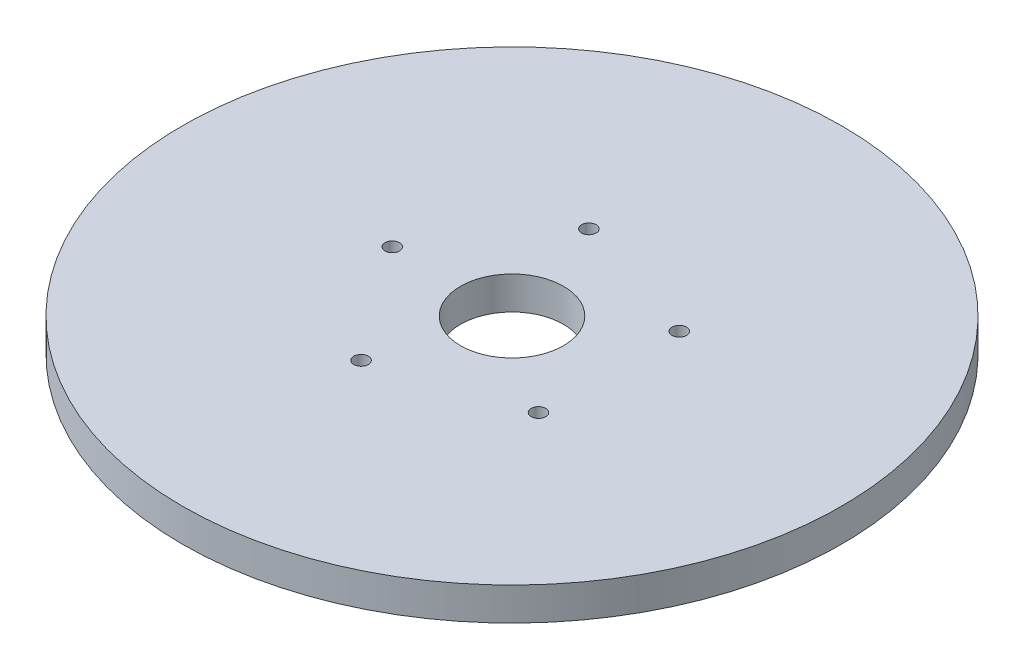
ISO-10303-21;
HEADER;
FILE_DESCRIPTION(('STEP AP214'),'2;1');
FILE_NAME('part.step','',(''),(''),'','','');
FILE_SCHEMA(('AUTOMOTIVE_DESIGN { 1 0 10303 214 1 1 1 1 }'));
ENDSEC;
DATA;
#1=APPLICATION_CONTEXT('core data for automotive mechanical design processes');
#2=APPLICATION_PROTOCOL_DEFINITION('international standard','automotive_design',2000,#1);
#3=PRODUCT_CONTEXT('',#1,'mechanical');
#4=PRODUCT('Part','Part','',(#3));
#5=PRODUCT_RELATED_PRODUCT_CATEGORY('part','',(#4));
#6=PRODUCT_DEFINITION_FORMATION('','',#4);
#7=PRODUCT_DEFINITION_CONTEXT('part definition',#1,'design');
#8=PRODUCT_DEFINITION('design','',#6,#7);
#9=PRODUCT_DEFINITION_SHAPE('','',#8);
#10=(LENGTH_UNIT() NAMED_UNIT(*) SI_UNIT(.MILLI.,.METRE.));
#11=(NAMED_UNIT(*) PLANE_ANGLE_UNIT() SI_UNIT($,.RADIAN.));
#12=(NAMED_UNIT(*) SI_UNIT($,.STERADIAN.) SOLID_ANGLE_UNIT());
#13=UNCERTAINTY_MEASURE_WITH_UNIT(LENGTH_MEASURE(1.E-05),#10,'distance_accuracy_value','');
#14=(GEOMETRIC_REPRESENTATION_CONTEXT(3) GLOBAL_UNCERTAINTY_ASSIGNED_CONTEXT((#13)) GLOBAL_UNIT_ASSIGNED_CONTEXT((#10,
#11,#12)) REPRESENTATION_CONTEXT('',''));
#15=CARTESIAN_POINT('',(0.,0.,0.));
#16=DIRECTION('',(0.,0.,1.));
#17=DIRECTION('',(1.,0.,0.));
#18=AXIS2_PLACEMENT_3D('',#15,#16,#17);
#19=CARTESIAN_POINT('',(0.,8.,0.));
#20=DIRECTION('',(0.,-1.,0.));
#21=DIRECTION('',(0.,0.,-1.));
#22=AXIS2_PLACEMENT_3D('',#19,#20,#21);
#23=CYLINDRICAL_SURFACE('',#22,80.);
#24=CARTESIAN_POINT('',(0.,8.,0.));
#25=DIRECTION('',(0.,1.,0.));
#26=DIRECTION('',(0.,0.,1.));
#27=AXIS2_PLACEMENT_3D('',#24,#25,#26);
#28=CIRCLE('',#27,80.);
#29=CARTESIAN_POINT('',(0.,8.,80.));
#30=VERTEX_POINT('',#29);
#31=EDGE_CURVE('E10',#30,#30,#28,.T.);
#32=ORIENTED_EDGE('',*,*,#31,.F.);
#33=EDGE_LOOP('',(#32));
#34=FACE_BOUND('',#33,.T.);
#35=CARTESIAN_POINT('',(0.,0.,0.));
#36=DIRECTION('',(0.,1.,0.));
#37=DIRECTION('',(0.,0.,1.));
#38=AXIS2_PLACEMENT_3D('',#35,#36,#37);
#39=CIRCLE('',#38,80.);
#40=CARTESIAN_POINT('',(0.,0.,80.));
#41=VERTEX_POINT('',#40);
#42=EDGE_CURVE('E37',#41,#41,#39,.T.);
#43=ORIENTED_EDGE('',*,*,#42,.T.);
#44=EDGE_LOOP('',(#43));
#45=FACE_BOUND('',#44,.T.);
#46=ADVANCED_FACE('F40',(#34,#45),#23,.T.);
#47=CARTESIAN_POINT('',(0.,8.,0.));
#48=DIRECTION('',(0.,1.,0.));
#49=DIRECTION('',(0.,0.,1.));
#50=AXIS2_PLACEMENT_3D('',#47,#48,#49);
#51=PLANE('',#50);
#52=CARTESIAN_POINT('',(-8.9832911943741,8.,27.6477274185769));
#53=DIRECTION('',(0.,1.,0.));
#54=DIRECTION('',(0.951056516295155,0.,0.309016994374945));
#55=AXIS2_PLACEMENT_3D('',#52,#53,#54);
#56=CIRCLE('',#55,1.76089961296019);
#57=CARTESIAN_POINT('',(-8.9832911943741,8.,29.408627031537));
#58=VERTEX_POINT('',#57);
#59=EDGE_CURVE('E78',#58,#58,#56,.T.);
#60=ORIENTED_EDGE('',*,*,#59,.F.);
#61=EDGE_LOOP('',(#60));
#62=FACE_BOUND('',#61,.T.);
#63=CARTESIAN_POINT('',(23.5185616777093,8.,17.0872352563727));
#64=DIRECTION('',(0.,1.,0.));
#65=DIRECTION('',(0.587785252292469,0.,-0.809016994374951));
#66=AXIS2_PLACEMENT_3D('',#63,#64,#65);
#67=CIRCLE('',#66,1.76089961296019);
#68=CARTESIAN_POINT('',(23.5185616777093,8.,18.8481348693329));
#69=VERTEX_POINT('',#68);
#70=EDGE_CURVE('E71',#69,#69,#67,.T.);
#71=ORIENTED_EDGE('',*,*,#70,.F.);
#72=EDGE_LOOP('',(#71));
#73=FACE_BOUND('',#72,.T.);
#74=CARTESIAN_POINT('',(23.5185616777091,8.,-17.0872352563731));
#75=DIRECTION('',(0.,1.,0.));
#76=DIRECTION('',(-0.58778525229248,0.,-0.809016994374942));
#77=AXIS2_PLACEMENT_3D('',#74,#75,#76);
#78=CIRCLE('',#77,1.76089961296019);
#79=CARTESIAN_POINT('',(23.5185616777091,8.,-15.3263356434129));
#80=VERTEX_POINT('',#79);
#81=EDGE_CURVE('E70',#80,#80,#78,.T.);
#82=ORIENTED_EDGE('',*,*,#81,.F.);
#83=EDGE_LOOP('',(#82));
#84=FACE_BOUND('',#83,.T.);
#85=CARTESIAN_POINT('',(-8.98329119437449,8.,-27.6477274185767));
#86=DIRECTION('',(0.,1.,0.));
#87=DIRECTION('',(-0.95105651629515,0.,0.309016994374958));
#88=AXIS2_PLACEMENT_3D('',#85,#86,#87);
#89=CIRCLE('',#88,1.76089961296019);
#90=CARTESIAN_POINT('',(-8.98329119437449,8.,-25.8868278056165));
#91=VERTEX_POINT('',#90);
#92=EDGE_CURVE('E61',#91,#91,#89,.T.);
#93=ORIENTED_EDGE('',*,*,#92,.F.);
#94=EDGE_LOOP('',(#93));
#95=FACE_BOUND('',#94,.T.);
#96=CARTESIAN_POINT('',(-29.0705409666701,8.,0.));
#97=DIRECTION('',(0.,1.,0.));
#98=DIRECTION('',(0.,0.,1.));
#99=AXIS2_PLACEMENT_3D('',#96,#97,#98);
#100=CIRCLE('',#99,1.76089961296019);
#101=CARTESIAN_POINT('',(-29.0705409666701,8.,1.76089961296019));
#102=VERTEX_POINT('',#101);
#103=EDGE_CURVE('E54',#102,#102,#100,.T.);
#104=ORIENTED_EDGE('',*,*,#103,.F.);
#105=EDGE_LOOP('',(#104));
#106=FACE_BOUND('',#105,.T.);
#107=CARTESIAN_POINT('',(0.,8.,0.));
#108=DIRECTION('',(0.,1.,0.));
#109=DIRECTION('',(0.,0.,1.));
#110=AXIS2_PLACEMENT_3D('',#107,#108,#109);
#111=CIRCLE('',#110,12.5);
#112=CARTESIAN_POINT('',(0.,8.,12.5));
#113=VERTEX_POINT('',#112);
#114=EDGE_CURVE('E50',#113,#113,#111,.T.);
#115=ORIENTED_EDGE('',*,*,#114,.F.);
#116=EDGE_LOOP('',(#115));
#117=FACE_BOUND('',#116,.T.);
#118=ORIENTED_EDGE('',*,*,#31,.T.);
#119=EDGE_LOOP('',(#118));
#120=FACE_BOUND('',#119,.T.);
#121=ADVANCED_FACE('F94',(#62,#73,#84,#95,#106,#117,#120),#51,.T.);
#122=CARTESIAN_POINT('',(0.,0.,0.));
#123=DIRECTION('',(0.,1.,0.));
#124=DIRECTION('',(0.,0.,1.));
#125=AXIS2_PLACEMENT_3D('',#122,#123,#124);
#126=PLANE('',#125);
#127=CARTESIAN_POINT('',(0.,0.,0.));
#128=DIRECTION('',(0.,1.,0.));
#129=DIRECTION('',(0.,0.,1.));
#130=AXIS2_PLACEMENT_3D('',#127,#128,#129);
#131=CIRCLE('',#130,12.5);
#132=CARTESIAN_POINT('',(0.,0.,12.5));
#133=VERTEX_POINT('',#132);
#134=EDGE_CURVE('E47',#133,#133,#131,.T.);
#135=ORIENTED_EDGE('',*,*,#134,.T.);
#136=EDGE_LOOP('',(#135));
#137=FACE_BOUND('',#136,.T.);
#138=ORIENTED_EDGE('',*,*,#42,.F.);
#139=EDGE_LOOP('',(#138));
#140=FACE_BOUND('',#139,.T.);
#141=ADVANCED_FACE('F100',(#137,#140),#126,.F.);
#142=CARTESIAN_POINT('',(0.,8.,0.));
#143=DIRECTION('',(0.,-1.,0.));
#144=DIRECTION('',(0.,0.,-1.));
#145=AXIS2_PLACEMENT_3D('',#142,#143,#144);
#146=CYLINDRICAL_SURFACE('',#145,12.5);
#147=ORIENTED_EDGE('',*,*,#114,.T.);
#148=EDGE_LOOP('',(#147));
#149=FACE_BOUND('',#148,.T.);
#150=ORIENTED_EDGE('',*,*,#134,.F.);
#151=EDGE_LOOP('',(#150));
#152=FACE_BOUND('',#151,.T.);
#153=ADVANCED_FACE('F108',(#149,#152),#146,.F.);
#154=CARTESIAN_POINT('',(-29.0705409666701,1.32016659838457,0.));
#155=DIRECTION('',(0.,1.,0.));
#156=DIRECTION('',(0.,0.,1.));
#157=AXIS2_PLACEMENT_3D('',#154,#155,#156);
#158=CYLINDRICAL_SURFACE('',#157,1.76089961296019);
#159=CARTESIAN_POINT('',(-29.0705409666701,1.32016659838457,0.));
#160=DIRECTION('',(0.,1.,0.));
#161=DIRECTION('',(0.,0.,1.));
#162=AXIS2_PLACEMENT_3D('',#159,#160,#161);
#163=CIRCLE('',#162,1.76089961296019);
#164=CARTESIAN_POINT('',(-29.0705409666701,1.32016659838456,1.76089961296019));
#165=VERTEX_POINT('',#164);
#166=EDGE_CURVE('E55',#165,#165,#163,.T.);
#167=CARTESIAN_POINT('',(-29.0705409666701,1.32016659838456,1.76089961296019));
#168=CARTESIAN_POINT('',(-29.0705409666701,1.38974819631806,1.76089961296019));
#169=CARTESIAN_POINT('',(-29.0705409666701,1.45932979425155,1.76089961296019));
#170=CARTESIAN_POINT('',(-29.0705409666701,1.59849299011854,1.76089961296019));
#171=CARTESIAN_POINT('',(-29.0705409666701,1.66807458805204,1.76089961296019));
#172=CARTESIAN_POINT('',(-29.0705409666701,1.80723778391902,1.76089961296019));
#173=CARTESIAN_POINT('',(-29.0705409666701,1.87681938185252,1.76089961296019));
#174=CARTESIAN_POINT('',(-29.0705409666701,2.01598257771951,1.76089961296019));
#175=CARTESIAN_POINT('',(-29.0705409666701,2.085564175653,1.76089961296019));
#176=CARTESIAN_POINT('',(-29.0705409666701,2.22472737151999,1.76089961296019));
#177=CARTESIAN_POINT('',(-29.0705409666701,2.29430896945348,1.76089961296019));
#178=CARTESIAN_POINT('',(-29.0705409666701,2.43347216532047,1.76089961296019));
#179=CARTESIAN_POINT('',(-29.0705409666701,2.50305376325396,1.76089961296019));
#180=CARTESIAN_POINT('',(-29.0705409666701,2.64221695912095,1.76089961296019));
#181=CARTESIAN_POINT('',(-29.0705409666701,2.71179855705445,1.76089961296019));
#182=CARTESIAN_POINT('',(-29.0705409666701,2.85096175292144,1.76089961296019));
#183=CARTESIAN_POINT('',(-29.0705409666701,2.92054335085493,1.76089961296019));
#184=CARTESIAN_POINT('',(-29.0705409666701,3.05970654672192,1.76089961296019));
#185=CARTESIAN_POINT('',(-29.0705409666701,3.12928814465541,1.76089961296019));
#186=CARTESIAN_POINT('',(-29.0705409666701,3.2684513405224,1.76089961296019));
#187=CARTESIAN_POINT('',(-29.0705409666701,3.33803293845589,1.76089961296019));
#188=CARTESIAN_POINT('',(-29.0705409666701,3.47719613432288,1.76089961296019));
#189=CARTESIAN_POINT('',(-29.0705409666701,3.54677773225638,1.76089961296019));
#190=CARTESIAN_POINT('',(-29.0705409666701,3.68594092812336,1.76089961296019));
#191=CARTESIAN_POINT('',(-29.0705409666701,3.75552252605686,1.76089961296019));
#192=CARTESIAN_POINT('',(-29.0705409666701,3.89468572192385,1.76089961296019));
#193=CARTESIAN_POINT('',(-29.0705409666701,3.96426731985734,1.76089961296019));
#194=CARTESIAN_POINT('',(-29.0705409666701,4.10343051572433,1.76089961296019));
#195=CARTESIAN_POINT('',(-29.0705409666701,4.17301211365782,1.76089961296019));
#196=CARTESIAN_POINT('',(-29.0705409666701,4.31217530952481,1.76089961296019));
#197=CARTESIAN_POINT('',(-29.0705409666701,4.38175690745831,1.76089961296019));
#198=CARTESIAN_POINT('',(-29.0705409666701,4.5209201033253,1.76089961296019));
#199=CARTESIAN_POINT('',(-29.0705409666701,4.59050170125879,1.76089961296019));
#200=CARTESIAN_POINT('',(-29.0705409666701,4.72966489712578,1.76089961296019));
#201=CARTESIAN_POINT('',(-29.0705409666701,4.79924649505927,1.76089961296019));
#202=CARTESIAN_POINT('',(-29.0705409666701,4.93840969092626,1.76089961296019));
#203=CARTESIAN_POINT('',(-29.0705409666701,5.00799128885975,1.76089961296019));
#204=CARTESIAN_POINT('',(-29.0705409666701,5.14715448472674,1.76089961296019));
#205=CARTESIAN_POINT('',(-29.0705409666701,5.21673608266024,1.76089961296019));
#206=CARTESIAN_POINT('',(-29.0705409666701,5.35589927852722,1.76089961296019));
#207=CARTESIAN_POINT('',(-29.0705409666701,5.42548087646072,1.76089961296019));
#208=CARTESIAN_POINT('',(-29.0705409666701,5.56464407232771,1.76089961296019));
#209=CARTESIAN_POINT('',(-29.0705409666701,5.6342256702612,1.76089961296019));
#210=CARTESIAN_POINT('',(-29.0705409666701,5.77338886612819,1.76089961296019));
#211=CARTESIAN_POINT('',(-29.0705409666701,5.84297046406168,1.76089961296019));
#212=CARTESIAN_POINT('',(-29.0705409666701,5.98213365992867,1.76089961296019));
#213=CARTESIAN_POINT('',(-29.0705409666701,6.05171525786216,1.76089961296019));
#214=CARTESIAN_POINT('',(-29.0705409666701,6.19087845372915,1.76089961296019));
#215=CARTESIAN_POINT('',(-29.0705409666701,6.26046005166265,1.76089961296019));
#216=CARTESIAN_POINT('',(-29.0705409666701,6.39962324752964,1.76089961296019));
#217=CARTESIAN_POINT('',(-29.0705409666701,6.46920484546313,1.76089961296019));
#218=CARTESIAN_POINT('',(-29.0705409666701,6.60836804133012,1.76089961296019));
#219=CARTESIAN_POINT('',(-29.0705409666701,6.67794963926361,1.76089961296019));
#220=CARTESIAN_POINT('',(-29.0705409666701,6.8171128351306,1.76089961296019));
#221=CARTESIAN_POINT('',(-29.0705409666701,6.88669443306409,1.76089961296019));
#222=CARTESIAN_POINT('',(-29.0705409666701,7.02585762893108,1.76089961296019));
#223=CARTESIAN_POINT('',(-29.0705409666701,7.09543922686458,1.76089961296019));
#224=CARTESIAN_POINT('',(-29.0705409666701,7.23460242273157,1.76089961296019));
#225=CARTESIAN_POINT('',(-29.0705409666701,7.30418402066506,1.76089961296019));
#226=CARTESIAN_POINT('',(-29.0705409666701,7.44334721653205,1.76089961296019));
#227=CARTESIAN_POINT('',(-29.0705409666701,7.51292881446554,1.76089961296019));
#228=CARTESIAN_POINT('',(-29.0705409666701,7.65209201033253,1.76089961296019));
#229=CARTESIAN_POINT('',(-29.0705409666701,7.72167360826602,1.76089961296019));
#230=CARTESIAN_POINT('',(-29.0705409666701,7.86083680413301,1.76089961296019));
#231=CARTESIAN_POINT('',(-29.0705409666701,7.9304184020665,1.76089961296019));
#232=CARTESIAN_POINT('',(-29.0705409666701,8.,1.76089961296019));
#233=B_SPLINE_CURVE_WITH_KNOTS('',3,(#167,#168,#169,#170,#171,#172,#173,#174,#175,#176,#177,
#178,#179,#180,#181,#182,#183,#184,#185,#186,#187,#188,#189,#190,#191,#192,#193,#194,#195,#196,
#197,#198,#199,#200,#201,#202,#203,#204,#205,#206,#207,#208,#209,#210,#211,#212,#213,#214,#215,
#216,#217,#218,#219,#220,#221,#222,#223,#224,#225,#226,#227,#228,#229,#230,#231,#232),
.UNSPECIFIED.,.F.,.F.,(4,2,2,2,2,2,2,2,2,2,2,2,2,2,2,2,2,2,2,2,2,2,2,2,2,2,2,2,2,2,2,2,4),(0.,
0.208744793800482,0.417489587600965,0.626234381401447,0.834979175201929,1.04372396900241,
1.25246876280289,1.46121355660338,1.66995835040386,1.87870314420434,2.08744793800482,
2.29619273180531,2.50493752560579,2.71368231940627,2.92242711320675,3.13117190700724,
3.33991670080772,3.5486614946082,3.75740628840868,3.96615108220916,4.17489587600965,
4.38364066981013,4.59238546361061,4.80113025741109,5.00987505121158,5.21861984501206,
5.42736463881254,5.63610943261302,5.84485422641351,6.05359902021399,6.26234381401447,
6.47108860781495,6.67983340161544),.UNSPECIFIED.);
#234=EDGE_CURVE('BSEAM115',#165,#102,#233,.T.);
#235=ORIENTED_EDGE('',*,*,#166,.F.);
#236=ORIENTED_EDGE('',*,*,#103,.T.);
#237=ORIENTED_EDGE('',*,*,#234,.T.);
#238=ORIENTED_EDGE('',*,*,#234,.F.);
#239=EDGE_LOOP('',(#235,#237,#236,#238));
#240=FACE_BOUND('',#239,.T.);
#241=ADVANCED_FACE('F115',(#240),#158,.F.);
#242=CARTESIAN_POINT('',(-29.0705409666701,1.32016659838457,0.));
#243=DIRECTION('',(0.,1.,0.));
#244=DIRECTION('',(0.,0.,1.));
#245=AXIS2_PLACEMENT_3D('',#242,#243,#244);
#246=PLANE('',#245);
#247=ORIENTED_EDGE('',*,*,#166,.T.);
#248=EDGE_LOOP('',(#247));
#249=FACE_BOUND('',#248,.T.);
#250=ADVANCED_FACE('F142',(#249),#246,.T.);
#251=CARTESIAN_POINT('',(-8.98329119437449,1.32016659838457,-27.6477274185767));
#252=DIRECTION('',(0.,1.,0.));
#253=DIRECTION('',(0.,0.,1.));
#254=AXIS2_PLACEMENT_3D('',#251,#252,#253);
#255=CYLINDRICAL_SURFACE('',#254,1.76089961296019);
#256=CARTESIAN_POINT('',(-8.98329119437449,1.32016659838457,-27.6477274185767));
#257=DIRECTION('',(0.,1.,0.));
#258=DIRECTION('',(-0.95105651629515,0.,0.309016994374958));
#259=AXIS2_PLACEMENT_3D('',#256,#257,#258);
#260=CIRCLE('',#259,1.76089961296019);
#261=CARTESIAN_POINT('',(-8.98329119437449,1.32016659838456,-25.8868278056165));
#262=VERTEX_POINT('',#261);
#263=EDGE_CURVE('E63',#262,#262,#260,.T.);
#264=CARTESIAN_POINT('',(-8.98329119437449,1.32016659838456,-25.8868278056165));
#265=CARTESIAN_POINT('',(-8.98329119437449,1.38974819631806,-25.8868278056165));
#266=CARTESIAN_POINT('',(-8.98329119437449,1.45932979425155,-25.8868278056165));
#267=CARTESIAN_POINT('',(-8.98329119437449,1.59849299011854,-25.8868278056165));
#268=CARTESIAN_POINT('',(-8.98329119437449,1.66807458805204,-25.8868278056165));
#269=CARTESIAN_POINT('',(-8.98329119437449,1.80723778391902,-25.8868278056165));
#270=CARTESIAN_POINT('',(-8.98329119437449,1.87681938185252,-25.8868278056165));
#271=CARTESIAN_POINT('',(-8.98329119437449,2.01598257771951,-25.8868278056165));
#272=CARTESIAN_POINT('',(-8.98329119437449,2.085564175653,-25.8868278056165));
#273=CARTESIAN_POINT('',(-8.98329119437449,2.22472737151999,-25.8868278056165));
#274=CARTESIAN_POINT('',(-8.98329119437449,2.29430896945348,-25.8868278056165));
#275=CARTESIAN_POINT('',(-8.98329119437449,2.43347216532047,-25.8868278056165));
#276=CARTESIAN_POINT('',(-8.98329119437449,2.50305376325396,-25.8868278056165));
#277=CARTESIAN_POINT('',(-8.98329119437449,2.64221695912095,-25.8868278056165));
#278=CARTESIAN_POINT('',(-8.98329119437449,2.71179855705445,-25.8868278056165));
#279=CARTESIAN_POINT('',(-8.98329119437449,2.85096175292144,-25.8868278056165));
#280=CARTESIAN_POINT('',(-8.98329119437449,2.92054335085493,-25.8868278056165));
#281=CARTESIAN_POINT('',(-8.98329119437449,3.05970654672192,-25.8868278056165));
#282=CARTESIAN_POINT('',(-8.98329119437449,3.12928814465541,-25.8868278056165));
#283=CARTESIAN_POINT('',(-8.98329119437449,3.2684513405224,-25.8868278056165));
#284=CARTESIAN_POINT('',(-8.98329119437449,3.33803293845589,-25.8868278056165));
#285=CARTESIAN_POINT('',(-8.98329119437449,3.47719613432288,-25.8868278056165));
#286=CARTESIAN_POINT('',(-8.98329119437449,3.54677773225638,-25.8868278056165));
#287=CARTESIAN_POINT('',(-8.98329119437449,3.68594092812336,-25.8868278056165));
#288=CARTESIAN_POINT('',(-8.98329119437449,3.75552252605686,-25.8868278056165));
#289=CARTESIAN_POINT('',(-8.98329119437449,3.89468572192385,-25.8868278056165));
#290=CARTESIAN_POINT('',(-8.98329119437449,3.96426731985734,-25.8868278056165));
#291=CARTESIAN_POINT('',(-8.98329119437449,4.10343051572433,-25.8868278056165));
#292=CARTESIAN_POINT('',(-8.98329119437449,4.17301211365782,-25.8868278056165));
#293=CARTESIAN_POINT('',(-8.98329119437449,4.31217530952481,-25.8868278056165));
#294=CARTESIAN_POINT('',(-8.98329119437449,4.38175690745831,-25.8868278056165));
#295=CARTESIAN_POINT('',(-8.98329119437449,4.5209201033253,-25.8868278056165));
#296=CARTESIAN_POINT('',(-8.98329119437449,4.59050170125879,-25.8868278056165));
#297=CARTESIAN_POINT('',(-8.98329119437449,4.72966489712578,-25.8868278056165));
#298=CARTESIAN_POINT('',(-8.98329119437449,4.79924649505927,-25.8868278056165));
#299=CARTESIAN_POINT('',(-8.98329119437449,4.93840969092626,-25.8868278056165));
#300=CARTESIAN_POINT('',(-8.98329119437449,5.00799128885975,-25.8868278056165));
#301=CARTESIAN_POINT('',(-8.98329119437449,5.14715448472674,-25.8868278056165));
#302=CARTESIAN_POINT('',(-8.98329119437449,5.21673608266024,-25.8868278056165));
#303=CARTESIAN_POINT('',(-8.98329119437449,5.35589927852722,-25.8868278056165));
#304=CARTESIAN_POINT('',(-8.98329119437449,5.42548087646072,-25.8868278056165));
#305=CARTESIAN_POINT('',(-8.98329119437449,5.56464407232771,-25.8868278056165));
#306=CARTESIAN_POINT('',(-8.98329119437449,5.6342256702612,-25.8868278056165));
#307=CARTESIAN_POINT('',(-8.98329119437449,5.77338886612819,-25.8868278056165));
#308=CARTESIAN_POINT('',(-8.98329119437449,5.84297046406168,-25.8868278056165));
#309=CARTESIAN_POINT('',(-8.98329119437449,5.98213365992867,-25.8868278056165));
#310=CARTESIAN_POINT('',(-8.98329119437449,6.05171525786216,-25.8868278056165));
#311=CARTESIAN_POINT('',(-8.98329119437449,6.19087845372915,-25.8868278056165));
#312=CARTESIAN_POINT('',(-8.98329119437449,6.26046005166265,-25.8868278056165));
#313=CARTESIAN_POINT('',(-8.98329119437449,6.39962324752964,-25.8868278056165));
#314=CARTESIAN_POINT('',(-8.98329119437449,6.46920484546313,-25.8868278056165));
#315=CARTESIAN_POINT('',(-8.98329119437449,6.60836804133012,-25.8868278056165));
#316=CARTESIAN_POINT('',(-8.98329119437449,6.67794963926361,-25.8868278056165));
#317=CARTESIAN_POINT('',(-8.98329119437449,6.8171128351306,-25.8868278056165));
#318=CARTESIAN_POINT('',(-8.98329119437449,6.88669443306409,-25.8868278056165));
#319=CARTESIAN_POINT('',(-8.98329119437449,7.02585762893108,-25.8868278056165));
#320=CARTESIAN_POINT('',(-8.98329119437449,7.09543922686458,-25.8868278056165));
#321=CARTESIAN_POINT('',(-8.98329119437449,7.23460242273157,-25.8868278056165));
#322=CARTESIAN_POINT('',(-8.98329119437449,7.30418402066506,-25.8868278056165));
#323=CARTESIAN_POINT('',(-8.98329119437449,7.44334721653205,-25.8868278056165));
#324=CARTESIAN_POINT('',(-8.98329119437449,7.51292881446554,-25.8868278056165));
#325=CARTESIAN_POINT('',(-8.98329119437449,7.65209201033253,-25.8868278056165));
#326=CARTESIAN_POINT('',(-8.98329119437449,7.72167360826602,-25.8868278056165));
#327=CARTESIAN_POINT('',(-8.98329119437449,7.86083680413301,-25.8868278056165));
#328=CARTESIAN_POINT('',(-8.98329119437449,7.9304184020665,-25.8868278056165));
#329=CARTESIAN_POINT('',(-8.98329119437449,8.,-25.8868278056165));
#330=B_SPLINE_CURVE_WITH_KNOTS('',3,(#264,#265,#266,#267,#268,#269,#270,#271,#272,#273,#274,
#275,#276,#277,#278,#279,#280,#281,#282,#283,#284,#285,#286,#287,#288,#289,#290,#291,#292,#293,
#294,#295,#296,#297,#298,#299,#300,#301,#302,#303,#304,#305,#306,#307,#308,#309,#310,#311,#312,
#313,#314,#315,#316,#317,#318,#319,#320,#321,#322,#323,#324,#325,#326,#327,#328,#329),
.UNSPECIFIED.,.F.,.F.,(4,2,2,2,2,2,2,2,2,2,2,2,2,2,2,2,2,2,2,2,2,2,2,2,2,2,2,2,2,2,2,2,4),(0.,
0.208744793800482,0.417489587600965,0.626234381401447,0.834979175201929,1.04372396900241,
1.25246876280289,1.46121355660338,1.66995835040386,1.87870314420434,2.08744793800482,
2.29619273180531,2.50493752560579,2.71368231940627,2.92242711320675,3.13117190700724,
3.33991670080772,3.5486614946082,3.75740628840868,3.96615108220916,4.17489587600965,
4.38364066981013,4.59238546361061,4.80113025741109,5.00987505121158,5.21861984501206,
5.42736463881254,5.63610943261302,5.84485422641351,6.05359902021399,6.26234381401447,
6.47108860781495,6.67983340161544),.UNSPECIFIED.);
#331=EDGE_CURVE('BSEAM147',#262,#91,#330,.T.);
#332=ORIENTED_EDGE('',*,*,#263,.F.);
#333=ORIENTED_EDGE('',*,*,#92,.T.);
#334=ORIENTED_EDGE('',*,*,#331,.T.);
#335=ORIENTED_EDGE('',*,*,#331,.F.);
#336=EDGE_LOOP('',(#332,#334,#333,#335));
#337=FACE_BOUND('',#336,.T.);
#338=ADVANCED_FACE('F147',(#337),#255,.F.);
#339=CARTESIAN_POINT('',(-8.98329119437449,1.32016659838457,-27.6477274185767));
#340=DIRECTION('',(0.,1.,0.));
#341=DIRECTION('',(-0.95105651629515,0.,0.309016994374958));
#342=AXIS2_PLACEMENT_3D('',#339,#340,#341);
#343=PLANE('',#342);
#344=ORIENTED_EDGE('',*,*,#263,.T.);
#345=EDGE_LOOP('',(#344));
#346=FACE_BOUND('',#345,.T.);
#347=ADVANCED_FACE('F163',(#346),#343,.T.);
#348=CARTESIAN_POINT('',(23.5185616777091,1.32016659838457,-17.0872352563731));
#349=DIRECTION('',(0.,1.,0.));
#350=DIRECTION('',(0.,0.,1.));
#351=AXIS2_PLACEMENT_3D('',#348,#349,#350);
#352=CYLINDRICAL_SURFACE('',#351,1.76089961296019);
#353=CARTESIAN_POINT('',(23.5185616777091,1.32016659838457,-17.0872352563731));
#354=DIRECTION('',(0.,1.,0.));
#355=DIRECTION('',(-0.58778525229248,0.,-0.809016994374942));
#356=AXIS2_PLACEMENT_3D('',#353,#354,#355);
#357=CIRCLE('',#356,1.76089961296019);
#358=CARTESIAN_POINT('',(23.5185616777091,1.32016659838456,-15.3263356434129));
#359=VERTEX_POINT('',#358);
#360=EDGE_CURVE('E69',#359,#359,#357,.T.);
#361=CARTESIAN_POINT('',(23.5185616777091,1.32016659838456,-15.3263356434129));
#362=CARTESIAN_POINT('',(23.5185616777091,1.38974819631806,-15.3263356434129));
#363=CARTESIAN_POINT('',(23.5185616777091,1.45932979425155,-15.3263356434129));
#364=CARTESIAN_POINT('',(23.5185616777091,1.59849299011854,-15.3263356434129));
#365=CARTESIAN_POINT('',(23.5185616777091,1.66807458805204,-15.3263356434129));
#366=CARTESIAN_POINT('',(23.5185616777091,1.80723778391902,-15.3263356434129));
#367=CARTESIAN_POINT('',(23.5185616777091,1.87681938185252,-15.3263356434129));
#368=CARTESIAN_POINT('',(23.5185616777091,2.01598257771951,-15.3263356434129));
#369=CARTESIAN_POINT('',(23.5185616777091,2.085564175653,-15.3263356434129));
#370=CARTESIAN_POINT('',(23.5185616777091,2.22472737151999,-15.3263356434129));
#371=CARTESIAN_POINT('',(23.5185616777091,2.29430896945348,-15.3263356434129));
#372=CARTESIAN_POINT('',(23.5185616777091,2.43347216532047,-15.3263356434129));
#373=CARTESIAN_POINT('',(23.5185616777091,2.50305376325396,-15.3263356434129));
#374=CARTESIAN_POINT('',(23.5185616777091,2.64221695912095,-15.3263356434129));
#375=CARTESIAN_POINT('',(23.5185616777091,2.71179855705445,-15.3263356434129));
#376=CARTESIAN_POINT('',(23.5185616777091,2.85096175292144,-15.3263356434129));
#377=CARTESIAN_POINT('',(23.5185616777091,2.92054335085493,-15.3263356434129));
#378=CARTESIAN_POINT('',(23.5185616777091,3.05970654672192,-15.3263356434129));
#379=CARTESIAN_POINT('',(23.5185616777091,3.12928814465541,-15.3263356434129));
#380=CARTESIAN_POINT('',(23.5185616777091,3.2684513405224,-15.3263356434129));
#381=CARTESIAN_POINT('',(23.5185616777091,3.33803293845589,-15.3263356434129));
#382=CARTESIAN_POINT('',(23.5185616777091,3.47719613432288,-15.3263356434129));
#383=CARTESIAN_POINT('',(23.5185616777091,3.54677773225638,-15.3263356434129));
#384=CARTESIAN_POINT('',(23.5185616777091,3.68594092812336,-15.3263356434129));
#385=CARTESIAN_POINT('',(23.5185616777091,3.75552252605686,-15.3263356434129));
#386=CARTESIAN_POINT('',(23.5185616777091,3.89468572192385,-15.3263356434129));
#387=CARTESIAN_POINT('',(23.5185616777091,3.96426731985734,-15.3263356434129));
#388=CARTESIAN_POINT('',(23.5185616777091,4.10343051572433,-15.3263356434129));
#389=CARTESIAN_POINT('',(23.5185616777091,4.17301211365782,-15.3263356434129));
#390=CARTESIAN_POINT('',(23.5185616777091,4.31217530952481,-15.3263356434129));
#391=CARTESIAN_POINT('',(23.5185616777091,4.38175690745831,-15.3263356434129));
#392=CARTESIAN_POINT('',(23.5185616777091,4.5209201033253,-15.3263356434129));
#393=CARTESIAN_POINT('',(23.5185616777091,4.59050170125879,-15.3263356434129));
#394=CARTESIAN_POINT('',(23.5185616777091,4.72966489712578,-15.3263356434129));
#395=CARTESIAN_POINT('',(23.5185616777091,4.79924649505927,-15.3263356434129));
#396=CARTESIAN_POINT('',(23.5185616777091,4.93840969092626,-15.3263356434129));
#397=CARTESIAN_POINT('',(23.5185616777091,5.00799128885975,-15.3263356434129));
#398=CARTESIAN_POINT('',(23.5185616777091,5.14715448472674,-15.3263356434129));
#399=CARTESIAN_POINT('',(23.5185616777091,5.21673608266024,-15.3263356434129));
#400=CARTESIAN_POINT('',(23.5185616777091,5.35589927852722,-15.3263356434129));
#401=CARTESIAN_POINT('',(23.5185616777091,5.42548087646072,-15.3263356434129));
#402=CARTESIAN_POINT('',(23.5185616777091,5.56464407232771,-15.3263356434129));
#403=CARTESIAN_POINT('',(23.5185616777091,5.6342256702612,-15.3263356434129));
#404=CARTESIAN_POINT('',(23.5185616777091,5.77338886612819,-15.3263356434129));
#405=CARTESIAN_POINT('',(23.5185616777091,5.84297046406168,-15.3263356434129));
#406=CARTESIAN_POINT('',(23.5185616777091,5.98213365992867,-15.3263356434129));
#407=CARTESIAN_POINT('',(23.5185616777091,6.05171525786216,-15.3263356434129));
#408=CARTESIAN_POINT('',(23.5185616777091,6.19087845372915,-15.3263356434129));
#409=CARTESIAN_POINT('',(23.5185616777091,6.26046005166265,-15.3263356434129));
#410=CARTESIAN_POINT('',(23.5185616777091,6.39962324752964,-15.3263356434129));
#411=CARTESIAN_POINT('',(23.5185616777091,6.46920484546313,-15.3263356434129));
#412=CARTESIAN_POINT('',(23.5185616777091,6.60836804133012,-15.3263356434129));
#413=CARTESIAN_POINT('',(23.5185616777091,6.67794963926361,-15.3263356434129));
#414=CARTESIAN_POINT('',(23.5185616777091,6.8171128351306,-15.3263356434129));
#415=CARTESIAN_POINT('',(23.5185616777091,6.88669443306409,-15.3263356434129));
#416=CARTESIAN_POINT('',(23.5185616777091,7.02585762893108,-15.3263356434129));
#417=CARTESIAN_POINT('',(23.5185616777091,7.09543922686458,-15.3263356434129));
#418=CARTESIAN_POINT('',(23.5185616777091,7.23460242273157,-15.3263356434129));
#419=CARTESIAN_POINT('',(23.5185616777091,7.30418402066506,-15.3263356434129));
#420=CARTESIAN_POINT('',(23.5185616777091,7.44334721653205,-15.3263356434129));
#421=CARTESIAN_POINT('',(23.5185616777091,7.51292881446554,-15.3263356434129));
#422=CARTESIAN_POINT('',(23.5185616777091,7.65209201033253,-15.3263356434129));
#423=CARTESIAN_POINT('',(23.5185616777091,7.72167360826602,-15.3263356434129));
#424=CARTESIAN_POINT('',(23.5185616777091,7.86083680413301,-15.3263356434129));
#425=CARTESIAN_POINT('',(23.5185616777091,7.9304184020665,-15.3263356434129));
#426=CARTESIAN_POINT('',(23.5185616777091,8.,-15.3263356434129));
#427=B_SPLINE_CURVE_WITH_KNOTS('',3,(#361,#362,#363,#364,#365,#366,#367,#368,#369,#370,#371,
#372,#373,#374,#375,#376,#377,#378,#379,#380,#381,#382,#383,#384,#385,#386,#387,#388,#389,#390,
#391,#392,#393,#394,#395,#396,#397,#398,#399,#400,#401,#402,#403,#404,#405,#406,#407,#408,#409,
#410,#411,#412,#413,#414,#415,#416,#417,#418,#419,#420,#421,#422,#423,#424,#425,#426),
.UNSPECIFIED.,.F.,.F.,(4,2,2,2,2,2,2,2,2,2,2,2,2,2,2,2,2,2,2,2,2,2,2,2,2,2,2,2,2,2,2,2,4),(0.,
0.208744793800482,0.417489587600965,0.626234381401447,0.834979175201929,1.04372396900241,
1.25246876280289,1.46121355660338,1.66995835040386,1.87870314420434,2.08744793800482,
2.29619273180531,2.50493752560579,2.71368231940627,2.92242711320675,3.13117190700724,
3.33991670080772,3.5486614946082,3.75740628840868,3.96615108220916,4.17489587600965,
4.38364066981013,4.59238546361061,4.80113025741109,5.00987505121158,5.21861984501206,
5.42736463881254,5.63610943261302,5.84485422641351,6.05359902021399,6.26234381401447,
6.47108860781495,6.67983340161544),.UNSPECIFIED.);
#428=EDGE_CURVE('BSEAM172',#359,#80,#427,.T.);
#429=ORIENTED_EDGE('',*,*,#360,.F.);
#430=ORIENTED_EDGE('',*,*,#81,.T.);
#431=ORIENTED_EDGE('',*,*,#428,.T.);
#432=ORIENTED_EDGE('',*,*,#428,.F.);
#433=EDGE_LOOP('',(#429,#431,#430,#432));
#434=FACE_BOUND('',#433,.T.);
#435=ADVANCED_FACE('F172',(#434),#352,.F.);
#436=CARTESIAN_POINT('',(23.5185616777091,1.32016659838457,-17.0872352563731));
#437=DIRECTION('',(0.,1.,0.));
#438=DIRECTION('',(-0.58778525229248,0.,-0.809016994374942));
#439=AXIS2_PLACEMENT_3D('',#436,#437,#438);
#440=PLANE('',#439);
#441=ORIENTED_EDGE('',*,*,#360,.T.);
#442=EDGE_LOOP('',(#441));
#443=FACE_BOUND('',#442,.T.);
#444=ADVANCED_FACE('F185',(#443),#440,.T.);
#445=CARTESIAN_POINT('',(23.5185616777093,1.32016659838457,17.0872352563727));
#446=DIRECTION('',(0.,1.,0.));
#447=DIRECTION('',(0.,0.,1.));
#448=AXIS2_PLACEMENT_3D('',#445,#446,#447);
#449=CYLINDRICAL_SURFACE('',#448,1.76089961296019);
#450=CARTESIAN_POINT('',(23.5185616777093,1.32016659838457,17.0872352563727));
#451=DIRECTION('',(0.,1.,0.));
#452=DIRECTION('',(0.587785252292469,0.,-0.809016994374951));
#453=AXIS2_PLACEMENT_3D('',#450,#451,#452);
#454=CIRCLE('',#453,1.76089961296019);
#455=CARTESIAN_POINT('',(23.5185616777093,1.32016659838456,18.8481348693329));
#456=VERTEX_POINT('',#455);
#457=EDGE_CURVE('E76',#456,#456,#454,.T.);
#458=CARTESIAN_POINT('',(23.5185616777093,1.32016659838456,18.8481348693329));
#459=CARTESIAN_POINT('',(23.5185616777093,1.38974819631806,18.8481348693329));
#460=CARTESIAN_POINT('',(23.5185616777093,1.45932979425155,18.8481348693329));
#461=CARTESIAN_POINT('',(23.5185616777093,1.59849299011854,18.8481348693329));
#462=CARTESIAN_POINT('',(23.5185616777093,1.66807458805204,18.8481348693329));
#463=CARTESIAN_POINT('',(23.5185616777093,1.80723778391902,18.8481348693329));
#464=CARTESIAN_POINT('',(23.5185616777093,1.87681938185252,18.8481348693329));
#465=CARTESIAN_POINT('',(23.5185616777093,2.01598257771951,18.8481348693329));
#466=CARTESIAN_POINT('',(23.5185616777093,2.085564175653,18.8481348693329));
#467=CARTESIAN_POINT('',(23.5185616777093,2.22472737151999,18.8481348693329));
#468=CARTESIAN_POINT('',(23.5185616777093,2.29430896945348,18.8481348693329));
#469=CARTESIAN_POINT('',(23.5185616777093,2.43347216532047,18.8481348693329));
#470=CARTESIAN_POINT('',(23.5185616777093,2.50305376325396,18.8481348693329));
#471=CARTESIAN_POINT('',(23.5185616777093,2.64221695912095,18.8481348693329));
#472=CARTESIAN_POINT('',(23.5185616777093,2.71179855705445,18.8481348693329));
#473=CARTESIAN_POINT('',(23.5185616777093,2.85096175292144,18.8481348693329));
#474=CARTESIAN_POINT('',(23.5185616777093,2.92054335085493,18.8481348693329));
#475=CARTESIAN_POINT('',(23.5185616777093,3.05970654672192,18.8481348693329));
#476=CARTESIAN_POINT('',(23.5185616777093,3.12928814465541,18.8481348693329));
#477=CARTESIAN_POINT('',(23.5185616777093,3.2684513405224,18.8481348693329));
#478=CARTESIAN_POINT('',(23.5185616777093,3.33803293845589,18.8481348693329));
#479=CARTESIAN_POINT('',(23.5185616777093,3.47719613432288,18.8481348693329));
#480=CARTESIAN_POINT('',(23.5185616777093,3.54677773225638,18.8481348693329));
#481=CARTESIAN_POINT('',(23.5185616777093,3.68594092812336,18.8481348693329));
#482=CARTESIAN_POINT('',(23.5185616777093,3.75552252605686,18.8481348693329));
#483=CARTESIAN_POINT('',(23.5185616777093,3.89468572192385,18.8481348693329));
#484=CARTESIAN_POINT('',(23.5185616777093,3.96426731985734,18.8481348693329));
#485=CARTESIAN_POINT('',(23.5185616777093,4.10343051572433,18.8481348693329));
#486=CARTESIAN_POINT('',(23.5185616777093,4.17301211365782,18.8481348693329));
#487=CARTESIAN_POINT('',(23.5185616777093,4.31217530952481,18.8481348693329));
#488=CARTESIAN_POINT('',(23.5185616777093,4.38175690745831,18.8481348693329));
#489=CARTESIAN_POINT('',(23.5185616777093,4.5209201033253,18.8481348693329));
#490=CARTESIAN_POINT('',(23.5185616777093,4.59050170125879,18.8481348693329));
#491=CARTESIAN_POINT('',(23.5185616777093,4.72966489712578,18.8481348693329));
#492=CARTESIAN_POINT('',(23.5185616777093,4.79924649505927,18.8481348693329));
#493=CARTESIAN_POINT('',(23.5185616777093,4.93840969092626,18.8481348693329));
#494=CARTESIAN_POINT('',(23.5185616777093,5.00799128885975,18.8481348693329));
#495=CARTESIAN_POINT('',(23.5185616777093,5.14715448472674,18.8481348693329));
#496=CARTESIAN_POINT('',(23.5185616777093,5.21673608266024,18.8481348693329));
#497=CARTESIAN_POINT('',(23.5185616777093,5.35589927852722,18.8481348693329));
#498=CARTESIAN_POINT('',(23.5185616777093,5.42548087646072,18.8481348693329));
#499=CARTESIAN_POINT('',(23.5185616777093,5.56464407232771,18.8481348693329));
#500=CARTESIAN_POINT('',(23.5185616777093,5.6342256702612,18.8481348693329));
#501=CARTESIAN_POINT('',(23.5185616777093,5.77338886612819,18.8481348693329));
#502=CARTESIAN_POINT('',(23.5185616777093,5.84297046406168,18.8481348693329));
#503=CARTESIAN_POINT('',(23.5185616777093,5.98213365992867,18.8481348693329));
#504=CARTESIAN_POINT('',(23.5185616777093,6.05171525786216,18.8481348693329));
#505=CARTESIAN_POINT('',(23.5185616777093,6.19087845372915,18.8481348693329));
#506=CARTESIAN_POINT('',(23.5185616777093,6.26046005166265,18.8481348693329));
#507=CARTESIAN_POINT('',(23.5185616777093,6.39962324752964,18.8481348693329));
#508=CARTESIAN_POINT('',(23.5185616777093,6.46920484546313,18.8481348693329));
#509=CARTESIAN_POINT('',(23.5185616777093,6.60836804133012,18.8481348693329));
#510=CARTESIAN_POINT('',(23.5185616777093,6.67794963926361,18.8481348693329));
#511=CARTESIAN_POINT('',(23.5185616777093,6.8171128351306,18.8481348693329));
#512=CARTESIAN_POINT('',(23.5185616777093,6.88669443306409,18.8481348693329));
#513=CARTESIAN_POINT('',(23.5185616777093,7.02585762893108,18.8481348693329));
#514=CARTESIAN_POINT('',(23.5185616777093,7.09543922686458,18.8481348693329));
#515=CARTESIAN_POINT('',(23.5185616777093,7.23460242273157,18.8481348693329));
#516=CARTESIAN_POINT('',(23.5185616777093,7.30418402066506,18.8481348693329));
#517=CARTESIAN_POINT('',(23.5185616777093,7.44334721653205,18.8481348693329));
#518=CARTESIAN_POINT('',(23.5185616777093,7.51292881446554,18.8481348693329));
#519=CARTESIAN_POINT('',(23.5185616777093,7.65209201033253,18.8481348693329));
#520=CARTESIAN_POINT('',(23.5185616777093,7.72167360826602,18.8481348693329));
#521=CARTESIAN_POINT('',(23.5185616777093,7.86083680413301,18.8481348693329));
#522=CARTESIAN_POINT('',(23.5185616777093,7.9304184020665,18.8481348693329));
#523=CARTESIAN_POINT('',(23.5185616777093,8.,18.8481348693329));
#524=B_SPLINE_CURVE_WITH_KNOTS('',3,(#458,#459,#460,#461,#462,#463,#464,#465,#466,#467,#468,
#469,#470,#471,#472,#473,#474,#475,#476,#477,#478,#479,#480,#481,#482,#483,#484,#485,#486,#487,
#488,#489,#490,#491,#492,#493,#494,#495,#496,#497,#498,#499,#500,#501,#502,#503,#504,#505,#506,
#507,#508,#509,#510,#511,#512,#513,#514,#515,#516,#517,#518,#519,#520,#521,#522,#523),
.UNSPECIFIED.,.F.,.F.,(4,2,2,2,2,2,2,2,2,2,2,2,2,2,2,2,2,2,2,2,2,2,2,2,2,2,2,2,2,2,2,2,4),(0.,
0.208744793800482,0.417489587600965,0.626234381401447,0.834979175201929,1.04372396900241,
1.25246876280289,1.46121355660338,1.66995835040386,1.87870314420434,2.08744793800482,
2.29619273180531,2.50493752560579,2.71368231940627,2.92242711320675,3.13117190700724,
3.33991670080772,3.5486614946082,3.75740628840868,3.96615108220916,4.17489587600965,
4.38364066981013,4.59238546361061,4.80113025741109,5.00987505121158,5.21861984501206,
5.42736463881254,5.63610943261302,5.84485422641351,6.05359902021399,6.26234381401447,
6.47108860781495,6.67983340161544),.UNSPECIFIED.);
#525=EDGE_CURVE('BSEAM191',#456,#69,#524,.T.);
#526=ORIENTED_EDGE('',*,*,#457,.F.);
#527=ORIENTED_EDGE('',*,*,#70,.T.);
#528=ORIENTED_EDGE('',*,*,#525,.T.);
#529=ORIENTED_EDGE('',*,*,#525,.F.);
#530=EDGE_LOOP('',(#526,#528,#527,#529));
#531=FACE_BOUND('',#530,.T.);
#532=ADVANCED_FACE('F191',(#531),#449,.F.);
#533=CARTESIAN_POINT('',(23.5185616777093,1.32016659838457,17.0872352563727));
#534=DIRECTION('',(0.,1.,0.));
#535=DIRECTION('',(0.587785252292469,0.,-0.809016994374951));
#536=AXIS2_PLACEMENT_3D('',#533,#534,#535);
#537=PLANE('',#536);
#538=ORIENTED_EDGE('',*,*,#457,.T.);
#539=EDGE_LOOP('',(#538));
#540=FACE_BOUND('',#539,.T.);
#541=ADVANCED_FACE('F89',(#540),#537,.T.);
#542=CARTESIAN_POINT('',(-8.9832911943741,1.32016659838457,27.6477274185769));
#543=DIRECTION('',(0.,1.,0.));
#544=DIRECTION('',(0.,0.,1.));
#545=AXIS2_PLACEMENT_3D('',#542,#543,#544);
#546=CYLINDRICAL_SURFACE('',#545,1.76089961296019);
#547=CARTESIAN_POINT('',(-8.9832911943741,1.32016659838457,27.6477274185769));
#548=DIRECTION('',(0.,1.,0.));
#549=DIRECTION('',(0.951056516295155,0.,0.309016994374945));
#550=AXIS2_PLACEMENT_3D('',#547,#548,#549);
#551=CIRCLE('',#550,1.76089961296019);
#552=CARTESIAN_POINT('',(-8.9832911943741,1.32016659838456,29.408627031537));
#553=VERTEX_POINT('',#552);
#554=EDGE_CURVE('E59',#553,#553,#551,.T.);
#555=CARTESIAN_POINT('',(-8.9832911943741,1.32016659838456,29.408627031537));
#556=CARTESIAN_POINT('',(-8.9832911943741,1.38974819631806,29.408627031537));
#557=CARTESIAN_POINT('',(-8.9832911943741,1.45932979425155,29.408627031537));
#558=CARTESIAN_POINT('',(-8.9832911943741,1.59849299011854,29.408627031537));
#559=CARTESIAN_POINT('',(-8.9832911943741,1.66807458805204,29.408627031537));
#560=CARTESIAN_POINT('',(-8.9832911943741,1.80723778391902,29.408627031537));
#561=CARTESIAN_POINT('',(-8.9832911943741,1.87681938185252,29.408627031537));
#562=CARTESIAN_POINT('',(-8.9832911943741,2.01598257771951,29.408627031537));
#563=CARTESIAN_POINT('',(-8.9832911943741,2.085564175653,29.408627031537));
#564=CARTESIAN_POINT('',(-8.9832911943741,2.22472737151999,29.408627031537));
#565=CARTESIAN_POINT('',(-8.9832911943741,2.29430896945348,29.408627031537));
#566=CARTESIAN_POINT('',(-8.9832911943741,2.43347216532047,29.408627031537));
#567=CARTESIAN_POINT('',(-8.9832911943741,2.50305376325396,29.408627031537));
#568=CARTESIAN_POINT('',(-8.9832911943741,2.64221695912095,29.408627031537));
#569=CARTESIAN_POINT('',(-8.9832911943741,2.71179855705445,29.408627031537));
#570=CARTESIAN_POINT('',(-8.9832911943741,2.85096175292144,29.408627031537));
#571=CARTESIAN_POINT('',(-8.9832911943741,2.92054335085493,29.408627031537));
#572=CARTESIAN_POINT('',(-8.9832911943741,3.05970654672192,29.408627031537));
#573=CARTESIAN_POINT('',(-8.9832911943741,3.12928814465541,29.408627031537));
#574=CARTESIAN_POINT('',(-8.9832911943741,3.2684513405224,29.408627031537));
#575=CARTESIAN_POINT('',(-8.9832911943741,3.33803293845589,29.408627031537));
#576=CARTESIAN_POINT('',(-8.9832911943741,3.47719613432288,29.408627031537));
#577=CARTESIAN_POINT('',(-8.9832911943741,3.54677773225638,29.408627031537));
#578=CARTESIAN_POINT('',(-8.9832911943741,3.68594092812336,29.408627031537));
#579=CARTESIAN_POINT('',(-8.9832911943741,3.75552252605686,29.408627031537));
#580=CARTESIAN_POINT('',(-8.9832911943741,3.89468572192385,29.408627031537));
#581=CARTESIAN_POINT('',(-8.9832911943741,3.96426731985734,29.408627031537));
#582=CARTESIAN_POINT('',(-8.9832911943741,4.10343051572433,29.408627031537));
#583=CARTESIAN_POINT('',(-8.9832911943741,4.17301211365782,29.408627031537));
#584=CARTESIAN_POINT('',(-8.9832911943741,4.31217530952481,29.408627031537));
#585=CARTESIAN_POINT('',(-8.9832911943741,4.38175690745831,29.408627031537));
#586=CARTESIAN_POINT('',(-8.9832911943741,4.5209201033253,29.408627031537));
#587=CARTESIAN_POINT('',(-8.9832911943741,4.59050170125879,29.408627031537));
#588=CARTESIAN_POINT('',(-8.9832911943741,4.72966489712578,29.408627031537));
#589=CARTESIAN_POINT('',(-8.9832911943741,4.79924649505927,29.408627031537));
#590=CARTESIAN_POINT('',(-8.9832911943741,4.93840969092626,29.408627031537));
#591=CARTESIAN_POINT('',(-8.9832911943741,5.00799128885975,29.408627031537));
#592=CARTESIAN_POINT('',(-8.9832911943741,5.14715448472674,29.408627031537));
#593=CARTESIAN_POINT('',(-8.9832911943741,5.21673608266024,29.408627031537));
#594=CARTESIAN_POINT('',(-8.9832911943741,5.35589927852722,29.408627031537));
#595=CARTESIAN_POINT('',(-8.9832911943741,5.42548087646072,29.408627031537));
#596=CARTESIAN_POINT('',(-8.9832911943741,5.56464407232771,29.408627031537));
#597=CARTESIAN_POINT('',(-8.9832911943741,5.6342256702612,29.408627031537));
#598=CARTESIAN_POINT('',(-8.9832911943741,5.77338886612819,29.408627031537));
#599=CARTESIAN_POINT('',(-8.9832911943741,5.84297046406168,29.408627031537));
#600=CARTESIAN_POINT('',(-8.9832911943741,5.98213365992867,29.408627031537));
#601=CARTESIAN_POINT('',(-8.9832911943741,6.05171525786216,29.408627031537));
#602=CARTESIAN_POINT('',(-8.9832911943741,6.19087845372915,29.408627031537));
#603=CARTESIAN_POINT('',(-8.9832911943741,6.26046005166265,29.408627031537));
#604=CARTESIAN_POINT('',(-8.9832911943741,6.39962324752964,29.408627031537));
#605=CARTESIAN_POINT('',(-8.9832911943741,6.46920484546313,29.408627031537));
#606=CARTESIAN_POINT('',(-8.9832911943741,6.60836804133012,29.408627031537));
#607=CARTESIAN_POINT('',(-8.9832911943741,6.67794963926361,29.408627031537));
#608=CARTESIAN_POINT('',(-8.9832911943741,6.8171128351306,29.408627031537));
#609=CARTESIAN_POINT('',(-8.9832911943741,6.88669443306409,29.408627031537));
#610=CARTESIAN_POINT('',(-8.9832911943741,7.02585762893108,29.408627031537));
#611=CARTESIAN_POINT('',(-8.9832911943741,7.09543922686458,29.408627031537));
#612=CARTESIAN_POINT('',(-8.9832911943741,7.23460242273157,29.408627031537));
#613=CARTESIAN_POINT('',(-8.9832911943741,7.30418402066506,29.408627031537));
#614=CARTESIAN_POINT('',(-8.9832911943741,7.44334721653205,29.408627031537));
#615=CARTESIAN_POINT('',(-8.9832911943741,7.51292881446554,29.408627031537));
#616=CARTESIAN_POINT('',(-8.9832911943741,7.65209201033253,29.408627031537));
#617=CARTESIAN_POINT('',(-8.9832911943741,7.72167360826602,29.408627031537));
#618=CARTESIAN_POINT('',(-8.9832911943741,7.86083680413301,29.408627031537));
#619=CARTESIAN_POINT('',(-8.9832911943741,7.9304184020665,29.408627031537));
#620=CARTESIAN_POINT('',(-8.9832911943741,8.,29.408627031537));
#621=B_SPLINE_CURVE_WITH_KNOTS('',3,(#555,#556,#557,#558,#559,#560,#561,#562,#563,#564,#565,
#566,#567,#568,#569,#570,#571,#572,#573,#574,#575,#576,#577,#578,#579,#580,#581,#582,#583,#584,
#585,#586,#587,#588,#589,#590,#591,#592,#593,#594,#595,#596,#597,#598,#599,#600,#601,#602,#603,
#604,#605,#606,#607,#608,#609,#610,#611,#612,#613,#614,#615,#616,#617,#618,#619,#620),
.UNSPECIFIED.,.F.,.F.,(4,2,2,2,2,2,2,2,2,2,2,2,2,2,2,2,2,2,2,2,2,2,2,2,2,2,2,2,2,2,2,2,4),(0.,
0.208744793800482,0.417489587600965,0.626234381401447,0.834979175201929,1.04372396900241,
1.25246876280289,1.46121355660338,1.66995835040386,1.87870314420434,2.08744793800482,
2.29619273180531,2.50493752560579,2.71368231940627,2.92242711320675,3.13117190700724,
3.33991670080772,3.5486614946082,3.75740628840868,3.96615108220916,4.17489587600965,
4.38364066981013,4.59238546361061,4.80113025741109,5.00987505121158,5.21861984501206,
5.42736463881254,5.63610943261302,5.84485422641351,6.05359902021399,6.26234381401447,
6.47108860781495,6.67983340161544),.UNSPECIFIED.);
#622=EDGE_CURVE('BSEAM87',#553,#58,#621,.T.);
#623=ORIENTED_EDGE('',*,*,#554,.F.);
#624=ORIENTED_EDGE('',*,*,#59,.T.);
#625=ORIENTED_EDGE('',*,*,#622,.T.);
#626=ORIENTED_EDGE('',*,*,#622,.F.);
#627=EDGE_LOOP('',(#623,#625,#624,#626));
#628=FACE_BOUND('',#627,.T.);
#629=ADVANCED_FACE('F87',(#628),#546,.F.);
#630=CARTESIAN_POINT('',(-8.9832911943741,1.32016659838457,27.6477274185769));
#631=DIRECTION('',(0.,1.,0.));
#632=DIRECTION('',(0.951056516295155,0.,0.309016994374945));
#633=AXIS2_PLACEMENT_3D('',#630,#631,#632);
#634=PLANE('',#633);
#635=ORIENTED_EDGE('',*,*,#554,.T.);
#636=EDGE_LOOP('',(#635));
#637=FACE_BOUND('',#636,.T.);
#638=ADVANCED_FACE('F84',(#637),#634,.T.);
#639=CLOSED_SHELL('',(#46,#121,#141,#153,#241,#250,#338,#347,#435,#444,#532,#541,#629,#638));
#640=MANIFOLD_SOLID_BREP('B2',#639);
#641=ADVANCED_BREP_SHAPE_REPRESENTATION('',(#18,#640),#14);
#642=SHAPE_DEFINITION_REPRESENTATION(#9,#641);
ENDSEC;
END-ISO-10303-21;
